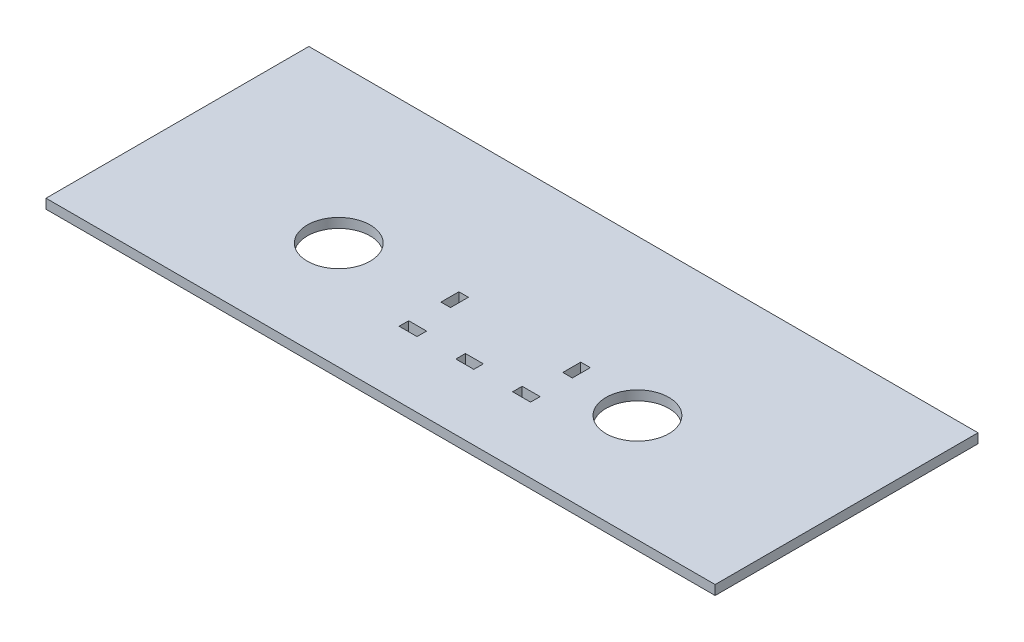
ISO-10303-21;
HEADER;
FILE_DESCRIPTION(('STEP AP214'),'2;1');
FILE_NAME('part.step','',(''),(''),'','','');
FILE_SCHEMA(('AUTOMOTIVE_DESIGN { 1 0 10303 214 1 1 1 1 }'));
ENDSEC;
DATA;
#1=APPLICATION_CONTEXT('core data for automotive mechanical design processes');
#2=APPLICATION_PROTOCOL_DEFINITION('international standard','automotive_design',2000,#1);
#3=PRODUCT_CONTEXT('',#1,'mechanical');
#4=PRODUCT('Part','Part','',(#3));
#5=PRODUCT_RELATED_PRODUCT_CATEGORY('part','',(#4));
#6=PRODUCT_DEFINITION_FORMATION('','',#4);
#7=PRODUCT_DEFINITION_CONTEXT('part definition',#1,'design');
#8=PRODUCT_DEFINITION('design','',#6,#7);
#9=PRODUCT_DEFINITION_SHAPE('','',#8);
#10=(LENGTH_UNIT() NAMED_UNIT(*) SI_UNIT(.MILLI.,.METRE.));
#11=(NAMED_UNIT(*) PLANE_ANGLE_UNIT() SI_UNIT($,.RADIAN.));
#12=(NAMED_UNIT(*) SI_UNIT($,.STERADIAN.) SOLID_ANGLE_UNIT());
#13=UNCERTAINTY_MEASURE_WITH_UNIT(LENGTH_MEASURE(1.E-05),#10,'distance_accuracy_value','');
#14=(GEOMETRIC_REPRESENTATION_CONTEXT(3) GLOBAL_UNCERTAINTY_ASSIGNED_CONTEXT((#13)) GLOBAL_UNIT_ASSIGNED_CONTEXT((#10,
#11,#12)) REPRESENTATION_CONTEXT('',''));
#15=CARTESIAN_POINT('',(0.,0.,0.));
#16=DIRECTION('',(0.,0.,1.));
#17=DIRECTION('',(1.,0.,0.));
#18=AXIS2_PLACEMENT_3D('',#15,#16,#17);
#19=CARTESIAN_POINT('',(-177.8,5.08,69.85));
#20=DIRECTION('',(1.,0.,0.));
#21=DIRECTION('',(0.,0.,-1.));
#22=AXIS2_PLACEMENT_3D('',#19,#20,#21);
#23=PLANE('',#22);
#24=DIRECTION('',(0.,0.,1.));
#25=VECTOR('',#24,1.);
#26=CARTESIAN_POINT('',(-177.8,0.,69.85));
#27=LINE('',#26,#25);
#28=CARTESIAN_POINT('',(-177.8,0.,-69.85));
#29=VERTEX_POINT('',#28);
#30=CARTESIAN_POINT('',(-177.8,0.,69.85));
#31=VERTEX_POINT('',#30);
#32=EDGE_CURVE('E366',#29,#31,#27,.T.);
#33=ORIENTED_EDGE('',*,*,#32,.T.);
#34=DIRECTION('',(0.,-1.,0.));
#35=VECTOR('',#34,1.);
#36=CARTESIAN_POINT('',(-177.8,5.08,69.85));
#37=LINE('',#36,#35);
#38=CARTESIAN_POINT('',(-177.8,5.08,69.85));
#39=VERTEX_POINT('',#38);
#40=EDGE_CURVE('E11',#39,#31,#37,.T.);
#41=ORIENTED_EDGE('',*,*,#40,.F.);
#42=DIRECTION('',(0.,0.,1.));
#43=VECTOR('',#42,1.);
#44=CARTESIAN_POINT('',(-177.8,5.08,69.85));
#45=LINE('',#44,#43);
#46=CARTESIAN_POINT('',(-177.8,5.08,-69.85));
#47=VERTEX_POINT('',#46);
#48=EDGE_CURVE('E375',#47,#39,#45,.T.);
#49=ORIENTED_EDGE('',*,*,#48,.F.);
#50=DIRECTION('',(0.,-1.,0.));
#51=VECTOR('',#50,1.);
#52=CARTESIAN_POINT('',(-177.8,5.08,-69.85));
#53=LINE('',#52,#51);
#54=EDGE_CURVE('E385',#47,#29,#53,.T.);
#55=ORIENTED_EDGE('',*,*,#54,.T.);
#56=EDGE_LOOP('',(#33,#41,#49,#55));
#57=FACE_BOUND('',#56,.T.);
#58=ADVANCED_FACE('F35',(#57),#23,.F.);
#59=CARTESIAN_POINT('',(177.8,5.08,69.85));
#60=DIRECTION('',(0.,0.,-1.));
#61=DIRECTION('',(-1.,0.,0.));
#62=AXIS2_PLACEMENT_3D('',#59,#60,#61);
#63=PLANE('',#62);
#64=DIRECTION('',(1.,0.,0.));
#65=VECTOR('',#64,1.);
#66=CARTESIAN_POINT('',(177.8,0.,69.85));
#67=LINE('',#66,#65);
#68=CARTESIAN_POINT('',(177.8,0.,69.85));
#69=VERTEX_POINT('',#68);
#70=EDGE_CURVE('E388',#31,#69,#67,.T.);
#71=ORIENTED_EDGE('',*,*,#70,.T.);
#72=DIRECTION('',(0.,-1.,0.));
#73=VECTOR('',#72,1.);
#74=CARTESIAN_POINT('',(177.8,5.08,69.85));
#75=LINE('',#74,#73);
#76=CARTESIAN_POINT('',(177.8,5.08,69.85));
#77=VERTEX_POINT('',#76);
#78=EDGE_CURVE('E42',#77,#69,#75,.T.);
#79=ORIENTED_EDGE('',*,*,#78,.F.);
#80=DIRECTION('',(1.,0.,0.));
#81=VECTOR('',#80,1.);
#82=CARTESIAN_POINT('',(177.8,5.08,69.85));
#83=LINE('',#82,#81);
#84=EDGE_CURVE('E378',#39,#77,#83,.T.);
#85=ORIENTED_EDGE('',*,*,#84,.F.);
#86=ORIENTED_EDGE('',*,*,#40,.T.);
#87=EDGE_LOOP('',(#71,#79,#85,#86));
#88=FACE_BOUND('',#87,.T.);
#89=ADVANCED_FACE('F417',(#88),#63,.F.);
#90=CARTESIAN_POINT('',(177.8,5.08,69.85));
#91=DIRECTION('',(-1.,0.,0.));
#92=DIRECTION('',(0.,0.,1.));
#93=AXIS2_PLACEMENT_3D('',#90,#91,#92);
#94=PLANE('',#93);
#95=DIRECTION('',(0.,0.,-1.));
#96=VECTOR('',#95,1.);
#97=CARTESIAN_POINT('',(177.8,0.,69.85));
#98=LINE('',#97,#96);
#99=CARTESIAN_POINT('',(177.8,0.,-69.85));
#100=VERTEX_POINT('',#99);
#101=EDGE_CURVE('E390',#69,#100,#98,.T.);
#102=ORIENTED_EDGE('',*,*,#101,.T.);
#103=DIRECTION('',(0.,-1.,0.));
#104=VECTOR('',#103,1.);
#105=CARTESIAN_POINT('',(177.8,5.08,-69.85));
#106=LINE('',#105,#104);
#107=CARTESIAN_POINT('',(177.8,5.08,-69.85));
#108=VERTEX_POINT('',#107);
#109=EDGE_CURVE('E395',#108,#100,#106,.T.);
#110=ORIENTED_EDGE('',*,*,#109,.F.);
#111=DIRECTION('',(0.,0.,-1.));
#112=VECTOR('',#111,1.);
#113=CARTESIAN_POINT('',(177.8,5.08,69.85));
#114=LINE('',#113,#112);
#115=EDGE_CURVE('E381',#77,#108,#114,.T.);
#116=ORIENTED_EDGE('',*,*,#115,.F.);
#117=ORIENTED_EDGE('',*,*,#78,.T.);
#118=EDGE_LOOP('',(#102,#110,#116,#117));
#119=FACE_BOUND('',#118,.T.);
#120=ADVANCED_FACE('F402',(#119),#94,.F.);
#121=CARTESIAN_POINT('',(177.8,5.08,-69.85));
#122=DIRECTION('',(0.,0.,1.));
#123=DIRECTION('',(1.,0.,0.));
#124=AXIS2_PLACEMENT_3D('',#121,#122,#123);
#125=PLANE('',#124);
#126=DIRECTION('',(-1.,0.,0.));
#127=VECTOR('',#126,1.);
#128=CARTESIAN_POINT('',(177.8,0.,-69.85));
#129=LINE('',#128,#127);
#130=EDGE_CURVE('E379',#100,#29,#129,.T.);
#131=ORIENTED_EDGE('',*,*,#130,.T.);
#132=ORIENTED_EDGE('',*,*,#54,.F.);
#133=DIRECTION('',(-1.,0.,0.));
#134=VECTOR('',#133,1.);
#135=CARTESIAN_POINT('',(177.8,5.08,-69.85));
#136=LINE('',#135,#134);
#137=EDGE_CURVE('E383',#108,#47,#136,.T.);
#138=ORIENTED_EDGE('',*,*,#137,.F.);
#139=ORIENTED_EDGE('',*,*,#109,.T.);
#140=EDGE_LOOP('',(#131,#132,#138,#139));
#141=FACE_BOUND('',#140,.T.);
#142=ADVANCED_FACE('F410',(#141),#125,.F.);
#143=CARTESIAN_POINT('',(0.,5.08,0.));
#144=DIRECTION('',(0.,1.,0.));
#145=DIRECTION('',(0.,0.,1.));
#146=AXIS2_PLACEMENT_3D('',#143,#144,#145);
#147=PLANE('',#146);
#148=DIRECTION('',(0.,0.,-1.));
#149=VECTOR('',#148,1.);
#150=CARTESIAN_POINT('',(44.8056,5.08,3.20039999999997));
#151=LINE('',#150,#149);
#152=CARTESIAN_POINT('',(44.8056,5.08,12.7254));
#153=VERTEX_POINT('',#152);
#154=CARTESIAN_POINT('',(44.8056,5.08,3.20039999999997));
#155=VERTEX_POINT('',#154);
#156=EDGE_CURVE('E49',#153,#155,#151,.T.);
#157=ORIENTED_EDGE('',*,*,#156,.F.);
#158=DIRECTION('',(1.,0.,0.));
#159=VECTOR('',#158,1.);
#160=CARTESIAN_POINT('',(44.8056,5.08,12.7254));
#161=LINE('',#160,#159);
#162=CARTESIAN_POINT('',(39.7256,5.08,12.7254));
#163=VERTEX_POINT('',#162);
#164=EDGE_CURVE('E306',#163,#153,#161,.T.);
#165=ORIENTED_EDGE('',*,*,#164,.F.);
#166=DIRECTION('',(0.,0.,1.));
#167=VECTOR('',#166,1.);
#168=CARTESIAN_POINT('',(39.7256,5.08,3.20039999999997));
#169=LINE('',#168,#167);
#170=CARTESIAN_POINT('',(39.7256,5.08,3.20039999999997));
#171=VERTEX_POINT('',#170);
#172=EDGE_CURVE('E320',#171,#163,#169,.T.);
#173=ORIENTED_EDGE('',*,*,#172,.F.);
#174=DIRECTION('',(-1.,0.,0.));
#175=VECTOR('',#174,1.);
#176=CARTESIAN_POINT('',(44.8056,5.08,3.20039999999997));
#177=LINE('',#176,#175);
#178=EDGE_CURVE('E317',#155,#171,#177,.T.);
#179=ORIENTED_EDGE('',*,*,#178,.F.);
#180=EDGE_LOOP('',(#157,#165,#173,#179));
#181=FACE_BOUND('',#180,.T.);
#182=DIRECTION('',(0.,0.,1.));
#183=VECTOR('',#182,1.);
#184=CARTESIAN_POINT('',(35.2806,5.08,29.8703999999999));
#185=LINE('',#184,#183);
#186=CARTESIAN_POINT('',(35.2806,5.08,29.8703999999999));
#187=VERTEX_POINT('',#186);
#188=CARTESIAN_POINT('',(35.2806,5.08,34.9504));
#189=VERTEX_POINT('',#188);
#190=EDGE_CURVE('E57',#187,#189,#185,.T.);
#191=ORIENTED_EDGE('',*,*,#190,.F.);
#192=DIRECTION('',(-1.,0.,0.));
#193=VECTOR('',#192,1.);
#194=CARTESIAN_POINT('',(35.2806,5.08,29.8703999999999));
#195=LINE('',#194,#193);
#196=CARTESIAN_POINT('',(44.8056,5.08,29.8703999999999));
#197=VERTEX_POINT('',#196);
#198=EDGE_CURVE('E276',#197,#187,#195,.T.);
#199=ORIENTED_EDGE('',*,*,#198,.F.);
#200=DIRECTION('',(0.,0.,-1.));
#201=VECTOR('',#200,1.);
#202=CARTESIAN_POINT('',(44.8056,5.08,29.8703999999999));
#203=LINE('',#202,#201);
#204=CARTESIAN_POINT('',(44.8056,5.08,34.9504));
#205=VERTEX_POINT('',#204);
#206=EDGE_CURVE('E291',#205,#197,#203,.T.);
#207=ORIENTED_EDGE('',*,*,#206,.F.);
#208=DIRECTION('',(1.,0.,0.));
#209=VECTOR('',#208,1.);
#210=CARTESIAN_POINT('',(35.2806,5.08,34.9504));
#211=LINE('',#210,#209);
#212=EDGE_CURVE('E287',#189,#205,#211,.T.);
#213=ORIENTED_EDGE('',*,*,#212,.F.);
#214=EDGE_LOOP('',(#191,#199,#207,#213));
#215=FACE_BOUND('',#214,.T.);
#216=DIRECTION('',(0.,0.,1.));
#217=VECTOR('',#216,1.);
#218=CARTESIAN_POINT('',(5.11810000000005,5.08,29.8703999999999));
#219=LINE('',#218,#217);
#220=CARTESIAN_POINT('',(5.11810000000005,5.08,29.8703999999999));
#221=VERTEX_POINT('',#220);
#222=CARTESIAN_POINT('',(5.11810000000005,5.08,34.9504));
#223=VERTEX_POINT('',#222);
#224=EDGE_CURVE('E254',#221,#223,#219,.T.);
#225=ORIENTED_EDGE('',*,*,#224,.F.);
#226=DIRECTION('',(-1.,0.,0.));
#227=VECTOR('',#226,1.);
#228=CARTESIAN_POINT('',(5.11810000000005,5.08,29.8703999999999));
#229=LINE('',#228,#227);
#230=CARTESIAN_POINT('',(14.6431,5.08,29.8703999999999));
#231=VERTEX_POINT('',#230);
#232=EDGE_CURVE('E244',#231,#221,#229,.T.);
#233=ORIENTED_EDGE('',*,*,#232,.F.);
#234=DIRECTION('',(0.,0.,-1.));
#235=VECTOR('',#234,1.);
#236=CARTESIAN_POINT('',(14.6431,5.08,29.8703999999999));
#237=LINE('',#236,#235);
#238=CARTESIAN_POINT('',(14.6431000000001,5.08,34.9504));
#239=VERTEX_POINT('',#238);
#240=EDGE_CURVE('E260',#239,#231,#237,.T.);
#241=ORIENTED_EDGE('',*,*,#240,.F.);
#242=DIRECTION('',(1.,0.,0.));
#243=VECTOR('',#242,1.);
#244=CARTESIAN_POINT('',(5.11810000000005,5.08,34.9504));
#245=LINE('',#244,#243);
#246=EDGE_CURVE('E256',#223,#239,#245,.T.);
#247=ORIENTED_EDGE('',*,*,#246,.F.);
#248=EDGE_LOOP('',(#225,#233,#241,#247));
#249=FACE_BOUND('',#248,.T.);
#250=DIRECTION('',(0.,0.,1.));
#251=VECTOR('',#250,1.);
#252=CARTESIAN_POINT('',(-25.0444,5.08,29.8704));
#253=LINE('',#252,#251);
#254=CARTESIAN_POINT('',(-25.0444,5.08,29.8704));
#255=VERTEX_POINT('',#254);
#256=CARTESIAN_POINT('',(-25.0444,5.08,34.9504));
#257=VERTEX_POINT('',#256);
#258=EDGE_CURVE('E202',#255,#257,#253,.T.);
#259=ORIENTED_EDGE('',*,*,#258,.F.);
#260=DIRECTION('',(-1.,0.,0.));
#261=VECTOR('',#260,1.);
#262=CARTESIAN_POINT('',(-25.0444,5.08,29.8704));
#263=LINE('',#262,#261);
#264=CARTESIAN_POINT('',(-15.5194,5.08,29.8704));
#265=VERTEX_POINT('',#264);
#266=EDGE_CURVE('E220',#265,#255,#263,.T.);
#267=ORIENTED_EDGE('',*,*,#266,.F.);
#268=DIRECTION('',(0.,0.,-1.));
#269=VECTOR('',#268,1.);
#270=CARTESIAN_POINT('',(-15.5194,5.08,29.8704));
#271=LINE('',#270,#269);
#272=CARTESIAN_POINT('',(-15.5194,5.08,34.9504));
#273=VERTEX_POINT('',#272);
#274=EDGE_CURVE('E223',#273,#265,#271,.T.);
#275=ORIENTED_EDGE('',*,*,#274,.F.);
#276=DIRECTION('',(1.,0.,0.));
#277=VECTOR('',#276,1.);
#278=CARTESIAN_POINT('',(-25.0444,5.08,34.9504));
#279=LINE('',#278,#277);
#280=EDGE_CURVE('E229',#257,#273,#279,.T.);
#281=ORIENTED_EDGE('',*,*,#280,.F.);
#282=EDGE_LOOP('',(#259,#267,#275,#281));
#283=FACE_BOUND('',#282,.T.);
#284=DIRECTION('',(0.,0.,1.));
#285=VECTOR('',#284,1.);
#286=CARTESIAN_POINT('',(-25.0444,5.08,3.20039999999998));
#287=LINE('',#286,#285);
#288=CARTESIAN_POINT('',(-25.0444,5.08,3.20039999999998));
#289=VERTEX_POINT('',#288);
#290=CARTESIAN_POINT('',(-25.0444,5.08,12.7254));
#291=VERTEX_POINT('',#290);
#292=EDGE_CURVE('E236',#289,#291,#287,.T.);
#293=ORIENTED_EDGE('',*,*,#292,.F.);
#294=DIRECTION('',(-1.,0.,0.));
#295=VECTOR('',#294,1.);
#296=CARTESIAN_POINT('',(-25.0444,5.08,3.20039999999998));
#297=LINE('',#296,#295);
#298=CARTESIAN_POINT('',(-19.9643999999999,5.08,3.20039999999998));
#299=VERTEX_POINT('',#298);
#300=EDGE_CURVE('E335',#299,#289,#297,.T.);
#301=ORIENTED_EDGE('',*,*,#300,.F.);
#302=DIRECTION('',(0.,0.,-1.));
#303=VECTOR('',#302,1.);
#304=CARTESIAN_POINT('',(-19.9643999999999,5.08,3.20039999999998));
#305=LINE('',#304,#303);
#306=CARTESIAN_POINT('',(-19.9643999999999,5.08,12.7254));
#307=VERTEX_POINT('',#306);
#308=EDGE_CURVE('E349',#307,#299,#305,.T.);
#309=ORIENTED_EDGE('',*,*,#308,.F.);
#310=DIRECTION('',(1.,0.,0.));
#311=VECTOR('',#310,1.);
#312=CARTESIAN_POINT('',(-25.0444,5.08,12.7254));
#313=LINE('',#312,#311);
#314=EDGE_CURVE('E346',#291,#307,#313,.T.);
#315=ORIENTED_EDGE('',*,*,#314,.F.);
#316=EDGE_LOOP('',(#293,#301,#309,#315));
#317=FACE_BOUND('',#316,.T.);
#318=CARTESIAN_POINT('',(-79.375,5.08,12.7));
#319=DIRECTION('',(0.,1.,0.));
#320=DIRECTION('',(0.,0.,1.));
#321=AXIS2_PLACEMENT_3D('',#318,#319,#320);
#322=CIRCLE('',#321,16.7005);
#323=CARTESIAN_POINT('',(-79.375,5.08,29.4005));
#324=VERTEX_POINT('',#323);
#325=EDGE_CURVE('E367',#324,#324,#322,.T.);
#326=ORIENTED_EDGE('',*,*,#325,.F.);
#327=EDGE_LOOP('',(#326));
#328=FACE_BOUND('',#327,.T.);
#329=CARTESIAN_POINT('',(79.375,5.08,12.6999999999999));
#330=DIRECTION('',(0.,1.,0.));
#331=DIRECTION('',(0.,0.,1.));
#332=AXIS2_PLACEMENT_3D('',#329,#330,#331);
#333=CIRCLE('',#332,16.7005);
#334=CARTESIAN_POINT('',(79.375,5.08,29.4004999999999));
#335=VERTEX_POINT('',#334);
#336=EDGE_CURVE('E356',#335,#335,#333,.T.);
#337=ORIENTED_EDGE('',*,*,#336,.F.);
#338=EDGE_LOOP('',(#337));
#339=FACE_BOUND('',#338,.T.);
#340=ORIENTED_EDGE('',*,*,#48,.T.);
#341=ORIENTED_EDGE('',*,*,#84,.T.);
#342=ORIENTED_EDGE('',*,*,#115,.T.);
#343=ORIENTED_EDGE('',*,*,#137,.T.);
#344=EDGE_LOOP('',(#340,#341,#342,#343));
#345=FACE_BOUND('',#344,.T.);
#346=ADVANCED_FACE('F416',(#181,#215,#249,#283,#317,#328,#339,#345),#147,.T.);
#347=CARTESIAN_POINT('',(0.,0.,0.));
#348=DIRECTION('',(0.,1.,0.));
#349=DIRECTION('',(0.,0.,1.));
#350=AXIS2_PLACEMENT_3D('',#347,#348,#349);
#351=PLANE('',#350);
#352=DIRECTION('',(1.,0.,0.));
#353=VECTOR('',#352,1.);
#354=CARTESIAN_POINT('',(44.8056,0.,12.7254));
#355=LINE('',#354,#353);
#356=CARTESIAN_POINT('',(39.7256,0.,12.7254));
#357=VERTEX_POINT('',#356);
#358=CARTESIAN_POINT('',(44.8056,0.,12.7254));
#359=VERTEX_POINT('',#358);
#360=EDGE_CURVE('E312',#357,#359,#355,.T.);
#361=ORIENTED_EDGE('',*,*,#360,.T.);
#362=DIRECTION('',(0.,0.,-1.));
#363=VECTOR('',#362,1.);
#364=CARTESIAN_POINT('',(44.8056,0.,3.20039999999997));
#365=LINE('',#364,#363);
#366=CARTESIAN_POINT('',(44.8056,0.,3.20039999999997));
#367=VERTEX_POINT('',#366);
#368=EDGE_CURVE('E302',#359,#367,#365,.T.);
#369=ORIENTED_EDGE('',*,*,#368,.T.);
#370=DIRECTION('',(-1.,0.,0.));
#371=VECTOR('',#370,1.);
#372=CARTESIAN_POINT('',(44.8056,0.,3.20039999999997));
#373=LINE('',#372,#371);
#374=CARTESIAN_POINT('',(39.7256,0.,3.20039999999997));
#375=VERTEX_POINT('',#374);
#376=EDGE_CURVE('E305',#367,#375,#373,.T.);
#377=ORIENTED_EDGE('',*,*,#376,.T.);
#378=DIRECTION('',(0.,0.,1.));
#379=VECTOR('',#378,1.);
#380=CARTESIAN_POINT('',(39.7256,0.,3.20039999999997));
#381=LINE('',#380,#379);
#382=EDGE_CURVE('E309',#375,#357,#381,.T.);
#383=ORIENTED_EDGE('',*,*,#382,.T.);
#384=EDGE_LOOP('',(#361,#369,#377,#383));
#385=FACE_BOUND('',#384,.T.);
#386=DIRECTION('',(-1.,0.,0.));
#387=VECTOR('',#386,1.);
#388=CARTESIAN_POINT('',(35.2806,0.,29.8703999999999));
#389=LINE('',#388,#387);
#390=CARTESIAN_POINT('',(44.8056,0.,29.8703999999999));
#391=VERTEX_POINT('',#390);
#392=CARTESIAN_POINT('',(35.2806,0.,29.8703999999999));
#393=VERTEX_POINT('',#392);
#394=EDGE_CURVE('E282',#391,#393,#389,.T.);
#395=ORIENTED_EDGE('',*,*,#394,.T.);
#396=DIRECTION('',(0.,0.,1.));
#397=VECTOR('',#396,1.);
#398=CARTESIAN_POINT('',(35.2806,0.,29.8703999999999));
#399=LINE('',#398,#397);
#400=CARTESIAN_POINT('',(35.2806,0.,34.9504));
#401=VERTEX_POINT('',#400);
#402=EDGE_CURVE('E272',#393,#401,#399,.T.);
#403=ORIENTED_EDGE('',*,*,#402,.T.);
#404=DIRECTION('',(1.,0.,0.));
#405=VECTOR('',#404,1.);
#406=CARTESIAN_POINT('',(35.2806,0.,34.9504));
#407=LINE('',#406,#405);
#408=CARTESIAN_POINT('',(44.8056,0.,34.9504));
#409=VERTEX_POINT('',#408);
#410=EDGE_CURVE('E275',#401,#409,#407,.T.);
#411=ORIENTED_EDGE('',*,*,#410,.T.);
#412=DIRECTION('',(0.,0.,-1.));
#413=VECTOR('',#412,1.);
#414=CARTESIAN_POINT('',(44.8056,0.,29.8703999999999));
#415=LINE('',#414,#413);
#416=EDGE_CURVE('E279',#409,#391,#415,.T.);
#417=ORIENTED_EDGE('',*,*,#416,.T.);
#418=EDGE_LOOP('',(#395,#403,#411,#417));
#419=FACE_BOUND('',#418,.T.);
#420=DIRECTION('',(-1.,0.,0.));
#421=VECTOR('',#420,1.);
#422=CARTESIAN_POINT('',(5.11810000000005,0.,29.8703999999999));
#423=LINE('',#422,#421);
#424=CARTESIAN_POINT('',(14.6431,0.,29.8703999999999));
#425=VERTEX_POINT('',#424);
#426=CARTESIAN_POINT('',(5.11810000000005,0.,29.8703999999999));
#427=VERTEX_POINT('',#426);
#428=EDGE_CURVE('E250',#425,#427,#423,.T.);
#429=ORIENTED_EDGE('',*,*,#428,.T.);
#430=DIRECTION('',(0.,0.,1.));
#431=VECTOR('',#430,1.);
#432=CARTESIAN_POINT('',(5.11810000000005,0.,29.8703999999999));
#433=LINE('',#432,#431);
#434=CARTESIAN_POINT('',(5.11810000000005,0.,34.9504));
#435=VERTEX_POINT('',#434);
#436=EDGE_CURVE('E240',#427,#435,#433,.T.);
#437=ORIENTED_EDGE('',*,*,#436,.T.);
#438=DIRECTION('',(1.,0.,0.));
#439=VECTOR('',#438,1.);
#440=CARTESIAN_POINT('',(5.11810000000005,0.,34.9504));
#441=LINE('',#440,#439);
#442=CARTESIAN_POINT('',(14.6431000000001,0.,34.9504));
#443=VERTEX_POINT('',#442);
#444=EDGE_CURVE('E243',#435,#443,#441,.T.);
#445=ORIENTED_EDGE('',*,*,#444,.T.);
#446=DIRECTION('',(0.,0.,-1.));
#447=VECTOR('',#446,1.);
#448=CARTESIAN_POINT('',(14.6431,0.,29.8703999999999));
#449=LINE('',#448,#447);
#450=EDGE_CURVE('E247',#443,#425,#449,.T.);
#451=ORIENTED_EDGE('',*,*,#450,.T.);
#452=EDGE_LOOP('',(#429,#437,#445,#451));
#453=FACE_BOUND('',#452,.T.);
#454=DIRECTION('',(-1.,0.,0.));
#455=VECTOR('',#454,1.);
#456=CARTESIAN_POINT('',(-25.0444,0.,29.8704));
#457=LINE('',#456,#455);
#458=CARTESIAN_POINT('',(-15.5194,0.,29.8704));
#459=VERTEX_POINT('',#458);
#460=CARTESIAN_POINT('',(-25.0444,0.,29.8704));
#461=VERTEX_POINT('',#460);
#462=EDGE_CURVE('E207',#459,#461,#457,.T.);
#463=ORIENTED_EDGE('',*,*,#462,.T.);
#464=DIRECTION('',(0.,0.,1.));
#465=VECTOR('',#464,1.);
#466=CARTESIAN_POINT('',(-25.0444,0.,29.8704));
#467=LINE('',#466,#465);
#468=CARTESIAN_POINT('',(-25.0444,0.,34.9504));
#469=VERTEX_POINT('',#468);
#470=EDGE_CURVE('E199',#461,#469,#467,.T.);
#471=ORIENTED_EDGE('',*,*,#470,.T.);
#472=DIRECTION('',(1.,0.,0.));
#473=VECTOR('',#472,1.);
#474=CARTESIAN_POINT('',(-25.0444,0.,34.9504));
#475=LINE('',#474,#473);
#476=CARTESIAN_POINT('',(-15.5194,0.,34.9504));
#477=VERTEX_POINT('',#476);
#478=EDGE_CURVE('E211',#469,#477,#475,.T.);
#479=ORIENTED_EDGE('',*,*,#478,.T.);
#480=DIRECTION('',(0.,0.,-1.));
#481=VECTOR('',#480,1.);
#482=CARTESIAN_POINT('',(-15.5194,0.,29.8704));
#483=LINE('',#482,#481);
#484=EDGE_CURVE('E215',#477,#459,#483,.T.);
#485=ORIENTED_EDGE('',*,*,#484,.T.);
#486=EDGE_LOOP('',(#463,#471,#479,#485));
#487=FACE_BOUND('',#486,.T.);
#488=DIRECTION('',(-1.,0.,0.));
#489=VECTOR('',#488,1.);
#490=CARTESIAN_POINT('',(-25.0444,0.,3.20039999999998));
#491=LINE('',#490,#489);
#492=CARTESIAN_POINT('',(-19.9643999999999,0.,3.20039999999998));
#493=VERTEX_POINT('',#492);
#494=CARTESIAN_POINT('',(-25.0444,0.,3.20039999999998));
#495=VERTEX_POINT('',#494);
#496=EDGE_CURVE('E341',#493,#495,#491,.T.);
#497=ORIENTED_EDGE('',*,*,#496,.T.);
#498=DIRECTION('',(0.,0.,1.));
#499=VECTOR('',#498,1.);
#500=CARTESIAN_POINT('',(-25.0444,0.,3.20039999999998));
#501=LINE('',#500,#499);
#502=CARTESIAN_POINT('',(-25.0444,0.,12.7254));
#503=VERTEX_POINT('',#502);
#504=EDGE_CURVE('E331',#495,#503,#501,.T.);
#505=ORIENTED_EDGE('',*,*,#504,.T.);
#506=DIRECTION('',(1.,0.,0.));
#507=VECTOR('',#506,1.);
#508=CARTESIAN_POINT('',(-25.0444,0.,12.7254));
#509=LINE('',#508,#507);
#510=CARTESIAN_POINT('',(-19.9643999999999,0.,12.7254));
#511=VERTEX_POINT('',#510);
#512=EDGE_CURVE('E334',#503,#511,#509,.T.);
#513=ORIENTED_EDGE('',*,*,#512,.T.);
#514=DIRECTION('',(0.,0.,-1.));
#515=VECTOR('',#514,1.);
#516=CARTESIAN_POINT('',(-19.9643999999999,0.,3.20039999999998));
#517=LINE('',#516,#515);
#518=EDGE_CURVE('E338',#511,#493,#517,.T.);
#519=ORIENTED_EDGE('',*,*,#518,.T.);
#520=EDGE_LOOP('',(#497,#505,#513,#519));
#521=FACE_BOUND('',#520,.T.);
#522=CARTESIAN_POINT('',(-79.375,0.,12.7));
#523=DIRECTION('',(0.,1.,0.));
#524=DIRECTION('',(0.,0.,1.));
#525=AXIS2_PLACEMENT_3D('',#522,#523,#524);
#526=CIRCLE('',#525,16.7005);
#527=CARTESIAN_POINT('',(-79.375,0.,29.4005));
#528=VERTEX_POINT('',#527);
#529=EDGE_CURVE('E363',#528,#528,#526,.T.);
#530=ORIENTED_EDGE('',*,*,#529,.T.);
#531=EDGE_LOOP('',(#530));
#532=FACE_BOUND('',#531,.T.);
#533=CARTESIAN_POINT('',(79.375,0.,12.6999999999999));
#534=DIRECTION('',(0.,1.,0.));
#535=DIRECTION('',(0.,0.,1.));
#536=AXIS2_PLACEMENT_3D('',#533,#534,#535);
#537=CIRCLE('',#536,16.7005);
#538=CARTESIAN_POINT('',(79.375,0.,29.4004999999999));
#539=VERTEX_POINT('',#538);
#540=EDGE_CURVE('E370',#539,#539,#537,.T.);
#541=ORIENTED_EDGE('',*,*,#540,.T.);
#542=EDGE_LOOP('',(#541));
#543=FACE_BOUND('',#542,.T.);
#544=ORIENTED_EDGE('',*,*,#32,.F.);
#545=ORIENTED_EDGE('',*,*,#130,.F.);
#546=ORIENTED_EDGE('',*,*,#101,.F.);
#547=ORIENTED_EDGE('',*,*,#70,.F.);
#548=EDGE_LOOP('',(#544,#545,#546,#547));
#549=FACE_BOUND('',#548,.T.);
#550=ADVANCED_FACE('F217',(#385,#419,#453,#487,#521,#532,#543,#549),#351,.F.);
#551=CARTESIAN_POINT('',(79.375,0.,12.6999999999999));
#552=DIRECTION('',(0.,1.,0.));
#553=DIRECTION('',(0.,0.,1.));
#554=AXIS2_PLACEMENT_3D('',#551,#552,#553);
#555=CYLINDRICAL_SURFACE('',#554,16.7005);
#556=ORIENTED_EDGE('',*,*,#540,.F.);
#557=EDGE_LOOP('',(#556));
#558=FACE_BOUND('',#557,.T.);
#559=ORIENTED_EDGE('',*,*,#336,.T.);
#560=EDGE_LOOP('',(#559));
#561=FACE_BOUND('',#560,.T.);
#562=ADVANCED_FACE('F429',(#558,#561),#555,.F.);
#563=CARTESIAN_POINT('',(-79.375,0.,12.7));
#564=DIRECTION('',(0.,1.,0.));
#565=DIRECTION('',(0.,0.,1.));
#566=AXIS2_PLACEMENT_3D('',#563,#564,#565);
#567=CYLINDRICAL_SURFACE('',#566,16.7005);
#568=ORIENTED_EDGE('',*,*,#529,.F.);
#569=EDGE_LOOP('',(#568));
#570=FACE_BOUND('',#569,.T.);
#571=ORIENTED_EDGE('',*,*,#325,.T.);
#572=EDGE_LOOP('',(#571));
#573=FACE_BOUND('',#572,.T.);
#574=ADVANCED_FACE('F436',(#570,#573),#567,.F.);
#575=CARTESIAN_POINT('',(-25.0444,0.,3.20039999999998));
#576=DIRECTION('',(-1.,0.,0.));
#577=DIRECTION('',(0.,0.,1.));
#578=AXIS2_PLACEMENT_3D('',#575,#576,#577);
#579=PLANE('',#578);
#580=ORIENTED_EDGE('',*,*,#292,.T.);
#581=DIRECTION('',(0.,1.,0.));
#582=VECTOR('',#581,1.);
#583=CARTESIAN_POINT('',(-25.0444,0.,12.7254));
#584=LINE('',#583,#582);
#585=EDGE_CURVE('E344',#503,#291,#584,.T.);
#586=ORIENTED_EDGE('',*,*,#585,.F.);
#587=ORIENTED_EDGE('',*,*,#504,.F.);
#588=DIRECTION('',(0.,1.,0.));
#589=VECTOR('',#588,1.);
#590=CARTESIAN_POINT('',(-25.0444,0.,3.20039999999998));
#591=LINE('',#590,#589);
#592=EDGE_CURVE('E354',#495,#289,#591,.T.);
#593=ORIENTED_EDGE('',*,*,#592,.T.);
#594=EDGE_LOOP('',(#580,#586,#587,#593));
#595=FACE_BOUND('',#594,.T.);
#596=ADVANCED_FACE('F440',(#595),#579,.F.);
#597=CARTESIAN_POINT('',(-25.0444,0.,3.20039999999998));
#598=DIRECTION('',(0.,0.,-1.));
#599=DIRECTION('',(-1.,0.,0.));
#600=AXIS2_PLACEMENT_3D('',#597,#598,#599);
#601=PLANE('',#600);
#602=ORIENTED_EDGE('',*,*,#300,.T.);
#603=ORIENTED_EDGE('',*,*,#592,.F.);
#604=ORIENTED_EDGE('',*,*,#496,.F.);
#605=DIRECTION('',(0.,1.,0.));
#606=VECTOR('',#605,1.);
#607=CARTESIAN_POINT('',(-19.9643999999999,0.,3.20039999999998));
#608=LINE('',#607,#606);
#609=EDGE_CURVE('E357',#493,#299,#608,.T.);
#610=ORIENTED_EDGE('',*,*,#609,.T.);
#611=EDGE_LOOP('',(#602,#603,#604,#610));
#612=FACE_BOUND('',#611,.T.);
#613=ADVANCED_FACE('F444',(#612),#601,.F.);
#614=CARTESIAN_POINT('',(-19.9643999999999,0.,3.20039999999998));
#615=DIRECTION('',(1.,0.,0.));
#616=DIRECTION('',(0.,0.,-1.));
#617=AXIS2_PLACEMENT_3D('',#614,#615,#616);
#618=PLANE('',#617);
#619=ORIENTED_EDGE('',*,*,#308,.T.);
#620=ORIENTED_EDGE('',*,*,#609,.F.);
#621=ORIENTED_EDGE('',*,*,#518,.F.);
#622=DIRECTION('',(0.,1.,0.));
#623=VECTOR('',#622,1.);
#624=CARTESIAN_POINT('',(-19.9643999999999,0.,12.7254));
#625=LINE('',#624,#623);
#626=EDGE_CURVE('E359',#511,#307,#625,.T.);
#627=ORIENTED_EDGE('',*,*,#626,.T.);
#628=EDGE_LOOP('',(#619,#620,#621,#627));
#629=FACE_BOUND('',#628,.T.);
#630=ADVANCED_FACE('F449',(#629),#618,.F.);
#631=CARTESIAN_POINT('',(-25.0444,0.,12.7254));
#632=DIRECTION('',(0.,0.,1.));
#633=DIRECTION('',(1.,0.,0.));
#634=AXIS2_PLACEMENT_3D('',#631,#632,#633);
#635=PLANE('',#634);
#636=ORIENTED_EDGE('',*,*,#314,.T.);
#637=ORIENTED_EDGE('',*,*,#626,.F.);
#638=ORIENTED_EDGE('',*,*,#512,.F.);
#639=ORIENTED_EDGE('',*,*,#585,.T.);
#640=EDGE_LOOP('',(#636,#637,#638,#639));
#641=FACE_BOUND('',#640,.T.);
#642=ADVANCED_FACE('F446',(#641),#635,.F.);
#643=CARTESIAN_POINT('',(-25.0444,0.,29.8704));
#644=DIRECTION('',(-1.,0.,0.));
#645=DIRECTION('',(0.,0.,1.));
#646=AXIS2_PLACEMENT_3D('',#643,#644,#645);
#647=PLANE('',#646);
#648=ORIENTED_EDGE('',*,*,#258,.T.);
#649=DIRECTION('',(0.,1.,0.));
#650=VECTOR('',#649,1.);
#651=CARTESIAN_POINT('',(-25.0444,0.,34.9504));
#652=LINE('',#651,#650);
#653=EDGE_CURVE('E195',#469,#257,#652,.T.);
#654=ORIENTED_EDGE('',*,*,#653,.F.);
#655=ORIENTED_EDGE('',*,*,#470,.F.);
#656=DIRECTION('',(0.,1.,0.));
#657=VECTOR('',#656,1.);
#658=CARTESIAN_POINT('',(-25.0444,0.,29.8704));
#659=LINE('',#658,#657);
#660=EDGE_CURVE('E234',#461,#255,#659,.T.);
#661=ORIENTED_EDGE('',*,*,#660,.T.);
#662=EDGE_LOOP('',(#648,#654,#655,#661));
#663=FACE_BOUND('',#662,.T.);
#664=ADVANCED_FACE('F197',(#663),#647,.F.);
#665=CARTESIAN_POINT('',(-25.0444,0.,29.8704));
#666=DIRECTION('',(0.,0.,-1.));
#667=DIRECTION('',(-1.,0.,0.));
#668=AXIS2_PLACEMENT_3D('',#665,#666,#667);
#669=PLANE('',#668);
#670=ORIENTED_EDGE('',*,*,#266,.T.);
#671=ORIENTED_EDGE('',*,*,#660,.F.);
#672=ORIENTED_EDGE('',*,*,#462,.F.);
#673=DIRECTION('',(0.,1.,0.));
#674=VECTOR('',#673,1.);
#675=CARTESIAN_POINT('',(-15.5194,0.,29.8704));
#676=LINE('',#675,#674);
#677=EDGE_CURVE('E237',#459,#265,#676,.T.);
#678=ORIENTED_EDGE('',*,*,#677,.T.);
#679=EDGE_LOOP('',(#670,#671,#672,#678));
#680=FACE_BOUND('',#679,.T.);
#681=ADVANCED_FACE('F505',(#680),#669,.F.);
#682=CARTESIAN_POINT('',(-15.5194,0.,29.8704));
#683=DIRECTION('',(1.,0.,0.));
#684=DIRECTION('',(0.,0.,-1.));
#685=AXIS2_PLACEMENT_3D('',#682,#683,#684);
#686=PLANE('',#685);
#687=ORIENTED_EDGE('',*,*,#274,.T.);
#688=ORIENTED_EDGE('',*,*,#677,.F.);
#689=ORIENTED_EDGE('',*,*,#484,.F.);
#690=DIRECTION('',(0.,1.,0.));
#691=VECTOR('',#690,1.);
#692=CARTESIAN_POINT('',(-15.5194,0.,34.9504));
#693=LINE('',#692,#691);
#694=EDGE_CURVE('E206',#477,#273,#693,.T.);
#695=ORIENTED_EDGE('',*,*,#694,.T.);
#696=EDGE_LOOP('',(#687,#688,#689,#695));
#697=FACE_BOUND('',#696,.T.);
#698=ADVANCED_FACE('F508',(#697),#686,.F.);
#699=CARTESIAN_POINT('',(-25.0444,0.,34.9504));
#700=DIRECTION('',(0.,0.,1.));
#701=DIRECTION('',(1.,0.,0.));
#702=AXIS2_PLACEMENT_3D('',#699,#700,#701);
#703=PLANE('',#702);
#704=ORIENTED_EDGE('',*,*,#280,.T.);
#705=ORIENTED_EDGE('',*,*,#694,.F.);
#706=ORIENTED_EDGE('',*,*,#478,.F.);
#707=ORIENTED_EDGE('',*,*,#653,.T.);
#708=EDGE_LOOP('',(#704,#705,#706,#707));
#709=FACE_BOUND('',#708,.T.);
#710=ADVANCED_FACE('F212',(#709),#703,.F.);
#711=CARTESIAN_POINT('',(5.11810000000005,0.,29.8703999999999));
#712=DIRECTION('',(-1.,0.,0.));
#713=DIRECTION('',(0.,0.,1.));
#714=AXIS2_PLACEMENT_3D('',#711,#712,#713);
#715=PLANE('',#714);
#716=ORIENTED_EDGE('',*,*,#224,.T.);
#717=DIRECTION('',(0.,1.,0.));
#718=VECTOR('',#717,1.);
#719=CARTESIAN_POINT('',(5.11810000000005,0.,34.9504));
#720=LINE('',#719,#718);
#721=EDGE_CURVE('E253',#435,#223,#720,.T.);
#722=ORIENTED_EDGE('',*,*,#721,.F.);
#723=ORIENTED_EDGE('',*,*,#436,.F.);
#724=DIRECTION('',(0.,1.,0.));
#725=VECTOR('',#724,1.);
#726=CARTESIAN_POINT('',(5.11810000000005,0.,29.8703999999999));
#727=LINE('',#726,#725);
#728=EDGE_CURVE('E230',#427,#221,#727,.T.);
#729=ORIENTED_EDGE('',*,*,#728,.T.);
#730=EDGE_LOOP('',(#716,#722,#723,#729));
#731=FACE_BOUND('',#730,.T.);
#732=ADVANCED_FACE('F488',(#731),#715,.F.);
#733=CARTESIAN_POINT('',(5.11810000000005,0.,29.8703999999999));
#734=DIRECTION('',(0.,0.,-1.));
#735=DIRECTION('',(-1.,0.,0.));
#736=AXIS2_PLACEMENT_3D('',#733,#734,#735);
#737=PLANE('',#736);
#738=ORIENTED_EDGE('',*,*,#232,.T.);
#739=ORIENTED_EDGE('',*,*,#728,.F.);
#740=ORIENTED_EDGE('',*,*,#428,.F.);
#741=DIRECTION('',(0.,1.,0.));
#742=VECTOR('',#741,1.);
#743=CARTESIAN_POINT('',(14.6431,0.,29.8703999999999));
#744=LINE('',#743,#742);
#745=EDGE_CURVE('E266',#425,#231,#744,.T.);
#746=ORIENTED_EDGE('',*,*,#745,.T.);
#747=EDGE_LOOP('',(#738,#739,#740,#746));
#748=FACE_BOUND('',#747,.T.);
#749=ADVANCED_FACE('F491',(#748),#737,.F.);
#750=CARTESIAN_POINT('',(14.6431,0.,29.8703999999999));
#751=DIRECTION('',(1.,0.,0.));
#752=DIRECTION('',(0.,0.,-1.));
#753=AXIS2_PLACEMENT_3D('',#750,#751,#752);
#754=PLANE('',#753);
#755=ORIENTED_EDGE('',*,*,#240,.T.);
#756=ORIENTED_EDGE('',*,*,#745,.F.);
#757=ORIENTED_EDGE('',*,*,#450,.F.);
#758=DIRECTION('',(0.,1.,0.));
#759=VECTOR('',#758,1.);
#760=CARTESIAN_POINT('',(14.6431000000001,0.,34.9504));
#761=LINE('',#760,#759);
#762=EDGE_CURVE('E268',#443,#239,#761,.T.);
#763=ORIENTED_EDGE('',*,*,#762,.T.);
#764=EDGE_LOOP('',(#755,#756,#757,#763));
#765=FACE_BOUND('',#764,.T.);
#766=ADVANCED_FACE('F495',(#765),#754,.F.);
#767=CARTESIAN_POINT('',(5.11810000000005,0.,34.9504));
#768=DIRECTION('',(0.,0.,1.));
#769=DIRECTION('',(1.,0.,0.));
#770=AXIS2_PLACEMENT_3D('',#767,#768,#769);
#771=PLANE('',#770);
#772=ORIENTED_EDGE('',*,*,#246,.T.);
#773=ORIENTED_EDGE('',*,*,#762,.F.);
#774=ORIENTED_EDGE('',*,*,#444,.F.);
#775=ORIENTED_EDGE('',*,*,#721,.T.);
#776=EDGE_LOOP('',(#772,#773,#774,#775));
#777=FACE_BOUND('',#776,.T.);
#778=ADVANCED_FACE('F477',(#777),#771,.F.);
#779=CARTESIAN_POINT('',(35.2806,0.,29.8703999999999));
#780=DIRECTION('',(-1.,0.,0.));
#781=DIRECTION('',(0.,0.,1.));
#782=AXIS2_PLACEMENT_3D('',#779,#780,#781);
#783=PLANE('',#782);
#784=ORIENTED_EDGE('',*,*,#190,.T.);
#785=DIRECTION('',(0.,1.,0.));
#786=VECTOR('',#785,1.);
#787=CARTESIAN_POINT('',(35.2806,0.,34.9504));
#788=LINE('',#787,#786);
#789=EDGE_CURVE('E285',#401,#189,#788,.T.);
#790=ORIENTED_EDGE('',*,*,#789,.F.);
#791=ORIENTED_EDGE('',*,*,#402,.F.);
#792=DIRECTION('',(0.,1.,0.));
#793=VECTOR('',#792,1.);
#794=CARTESIAN_POINT('',(35.2806,0.,29.8703999999999));
#795=LINE('',#794,#793);
#796=EDGE_CURVE('E257',#393,#187,#795,.T.);
#797=ORIENTED_EDGE('',*,*,#796,.T.);
#798=EDGE_LOOP('',(#784,#790,#791,#797));
#799=FACE_BOUND('',#798,.T.);
#800=ADVANCED_FACE('F473',(#799),#783,.F.);
#801=CARTESIAN_POINT('',(35.2806,0.,29.8703999999999));
#802=DIRECTION('',(0.,0.,-1.));
#803=DIRECTION('',(-1.,0.,0.));
#804=AXIS2_PLACEMENT_3D('',#801,#802,#803);
#805=PLANE('',#804);
#806=ORIENTED_EDGE('',*,*,#198,.T.);
#807=ORIENTED_EDGE('',*,*,#796,.F.);
#808=ORIENTED_EDGE('',*,*,#394,.F.);
#809=DIRECTION('',(0.,1.,0.));
#810=VECTOR('',#809,1.);
#811=CARTESIAN_POINT('',(44.8056,0.,29.8703999999999));
#812=LINE('',#811,#810);
#813=EDGE_CURVE('E297',#391,#197,#812,.T.);
#814=ORIENTED_EDGE('',*,*,#813,.T.);
#815=EDGE_LOOP('',(#806,#807,#808,#814));
#816=FACE_BOUND('',#815,.T.);
#817=ADVANCED_FACE('F476',(#816),#805,.F.);
#818=CARTESIAN_POINT('',(44.8056,0.,29.8703999999999));
#819=DIRECTION('',(1.,0.,0.));
#820=DIRECTION('',(0.,0.,-1.));
#821=AXIS2_PLACEMENT_3D('',#818,#819,#820);
#822=PLANE('',#821);
#823=ORIENTED_EDGE('',*,*,#206,.T.);
#824=ORIENTED_EDGE('',*,*,#813,.F.);
#825=ORIENTED_EDGE('',*,*,#416,.F.);
#826=DIRECTION('',(0.,1.,0.));
#827=VECTOR('',#826,1.);
#828=CARTESIAN_POINT('',(44.8056,0.,34.9504));
#829=LINE('',#828,#827);
#830=EDGE_CURVE('E299',#409,#205,#829,.T.);
#831=ORIENTED_EDGE('',*,*,#830,.T.);
#832=EDGE_LOOP('',(#823,#824,#825,#831));
#833=FACE_BOUND('',#832,.T.);
#834=ADVANCED_FACE('F480',(#833),#822,.F.);
#835=CARTESIAN_POINT('',(35.2806,0.,34.9504));
#836=DIRECTION('',(0.,0.,1.));
#837=DIRECTION('',(1.,0.,0.));
#838=AXIS2_PLACEMENT_3D('',#835,#836,#837);
#839=PLANE('',#838);
#840=ORIENTED_EDGE('',*,*,#212,.T.);
#841=ORIENTED_EDGE('',*,*,#830,.F.);
#842=ORIENTED_EDGE('',*,*,#410,.F.);
#843=ORIENTED_EDGE('',*,*,#789,.T.);
#844=EDGE_LOOP('',(#840,#841,#842,#843));
#845=FACE_BOUND('',#844,.T.);
#846=ADVANCED_FACE('F461',(#845),#839,.F.);
#847=CARTESIAN_POINT('',(44.8056,0.,3.20039999999997));
#848=DIRECTION('',(1.,0.,0.));
#849=DIRECTION('',(0.,0.,-1.));
#850=AXIS2_PLACEMENT_3D('',#847,#848,#849);
#851=PLANE('',#850);
#852=ORIENTED_EDGE('',*,*,#156,.T.);
#853=DIRECTION('',(0.,1.,0.));
#854=VECTOR('',#853,1.);
#855=CARTESIAN_POINT('',(44.8056,0.,3.20039999999997));
#856=LINE('',#855,#854);
#857=EDGE_CURVE('E315',#367,#155,#856,.T.);
#858=ORIENTED_EDGE('',*,*,#857,.F.);
#859=ORIENTED_EDGE('',*,*,#368,.F.);
#860=DIRECTION('',(0.,1.,0.));
#861=VECTOR('',#860,1.);
#862=CARTESIAN_POINT('',(44.8056,0.,12.7254));
#863=LINE('',#862,#861);
#864=EDGE_CURVE('E288',#359,#153,#863,.T.);
#865=ORIENTED_EDGE('',*,*,#864,.T.);
#866=EDGE_LOOP('',(#852,#858,#859,#865));
#867=FACE_BOUND('',#866,.T.);
#868=ADVANCED_FACE('F457',(#867),#851,.F.);
#869=CARTESIAN_POINT('',(44.8056,0.,12.7254));
#870=DIRECTION('',(0.,0.,1.));
#871=DIRECTION('',(1.,0.,0.));
#872=AXIS2_PLACEMENT_3D('',#869,#870,#871);
#873=PLANE('',#872);
#874=ORIENTED_EDGE('',*,*,#164,.T.);
#875=ORIENTED_EDGE('',*,*,#864,.F.);
#876=ORIENTED_EDGE('',*,*,#360,.F.);
#877=DIRECTION('',(0.,1.,0.));
#878=VECTOR('',#877,1.);
#879=CARTESIAN_POINT('',(39.7256,0.,12.7254));
#880=LINE('',#879,#878);
#881=EDGE_CURVE('E326',#357,#163,#880,.T.);
#882=ORIENTED_EDGE('',*,*,#881,.T.);
#883=EDGE_LOOP('',(#874,#875,#876,#882));
#884=FACE_BOUND('',#883,.T.);
#885=ADVANCED_FACE('F460',(#884),#873,.F.);
#886=CARTESIAN_POINT('',(39.7256,0.,3.20039999999997));
#887=DIRECTION('',(-1.,0.,0.));
#888=DIRECTION('',(0.,0.,1.));
#889=AXIS2_PLACEMENT_3D('',#886,#887,#888);
#890=PLANE('',#889);
#891=ORIENTED_EDGE('',*,*,#172,.T.);
#892=ORIENTED_EDGE('',*,*,#881,.F.);
#893=ORIENTED_EDGE('',*,*,#382,.F.);
#894=DIRECTION('',(0.,1.,0.));
#895=VECTOR('',#894,1.);
#896=CARTESIAN_POINT('',(39.7256,0.,3.20039999999997));
#897=LINE('',#896,#895);
#898=EDGE_CURVE('E328',#375,#171,#897,.T.);
#899=ORIENTED_EDGE('',*,*,#898,.T.);
#900=EDGE_LOOP('',(#891,#892,#893,#899));
#901=FACE_BOUND('',#900,.T.);
#902=ADVANCED_FACE('F465',(#901),#890,.F.);
#903=CARTESIAN_POINT('',(44.8056,0.,3.20039999999997));
#904=DIRECTION('',(0.,0.,-1.));
#905=DIRECTION('',(-1.,0.,0.));
#906=AXIS2_PLACEMENT_3D('',#903,#904,#905);
#907=PLANE('',#906);
#908=ORIENTED_EDGE('',*,*,#178,.T.);
#909=ORIENTED_EDGE('',*,*,#898,.F.);
#910=ORIENTED_EDGE('',*,*,#376,.F.);
#911=ORIENTED_EDGE('',*,*,#857,.T.);
#912=EDGE_LOOP('',(#908,#909,#910,#911));
#913=FACE_BOUND('',#912,.T.);
#914=ADVANCED_FACE('F462',(#913),#907,.F.);
#915=CLOSED_SHELL('',(#58,#89,#120,#142,#346,#550,#562,#574,#596,#613,#630,#642,#664,#681,#698,
#710,#732,#749,#766,#778,#800,#817,#834,#846,#868,#885,#902,#914));
#916=MANIFOLD_SOLID_BREP('B2',#915);
#917=ADVANCED_BREP_SHAPE_REPRESENTATION('',(#18,#916),#14);
#918=SHAPE_DEFINITION_REPRESENTATION(#9,#917);
ENDSEC;
END-ISO-10303-21;
